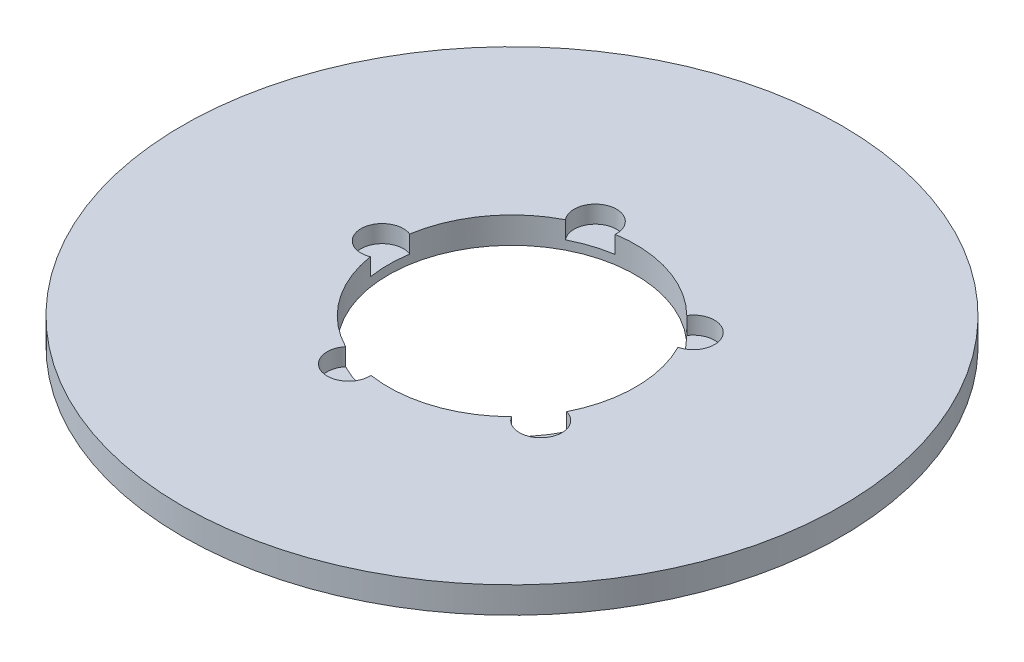
ISO-10303-21;
HEADER;
FILE_DESCRIPTION(('STEP AP214'),'2;1');
FILE_NAME('part.step','',(''),(''),'','','');
FILE_SCHEMA(('AUTOMOTIVE_DESIGN { 1 0 10303 214 1 1 1 1 }'));
ENDSEC;
DATA;
#1=APPLICATION_CONTEXT('core data for automotive mechanical design processes');
#2=APPLICATION_PROTOCOL_DEFINITION('international standard','automotive_design',2000,#1);
#3=PRODUCT_CONTEXT('',#1,'mechanical');
#4=PRODUCT('Part','Part','',(#3));
#5=PRODUCT_RELATED_PRODUCT_CATEGORY('part','',(#4));
#6=PRODUCT_DEFINITION_FORMATION('','',#4);
#7=PRODUCT_DEFINITION_CONTEXT('part definition',#1,'design');
#8=PRODUCT_DEFINITION('design','',#6,#7);
#9=PRODUCT_DEFINITION_SHAPE('','',#8);
#10=(LENGTH_UNIT() NAMED_UNIT(*) SI_UNIT(.MILLI.,.METRE.));
#11=(NAMED_UNIT(*) PLANE_ANGLE_UNIT() SI_UNIT($,.RADIAN.));
#12=(NAMED_UNIT(*) SI_UNIT($,.STERADIAN.) SOLID_ANGLE_UNIT());
#13=UNCERTAINTY_MEASURE_WITH_UNIT(LENGTH_MEASURE(1.E-05),#10,'distance_accuracy_value','');
#14=(GEOMETRIC_REPRESENTATION_CONTEXT(3) GLOBAL_UNCERTAINTY_ASSIGNED_CONTEXT((#13)) GLOBAL_UNIT_ASSIGNED_CONTEXT((#10,
#11,#12)) REPRESENTATION_CONTEXT('',''));
#15=CARTESIAN_POINT('',(0.,0.,0.));
#16=DIRECTION('',(0.,0.,1.));
#17=DIRECTION('',(1.,0.,0.));
#18=AXIS2_PLACEMENT_3D('',#15,#16,#17);
#19=CARTESIAN_POINT('',(0.,8.,0.));
#20=DIRECTION('',(0.,-1.,0.));
#21=DIRECTION('',(0.,0.,-1.));
#22=AXIS2_PLACEMENT_3D('',#19,#20,#21);
#23=CYLINDRICAL_SURFACE('',#22,100.);
#24=CARTESIAN_POINT('',(0.,8.,0.));
#25=DIRECTION('',(0.,1.,0.));
#26=DIRECTION('',(0.,0.,1.));
#27=AXIS2_PLACEMENT_3D('',#24,#25,#26);
#28=CIRCLE('',#27,100.);
#29=CARTESIAN_POINT('',(0.,8.,100.));
#30=VERTEX_POINT('',#29);
#31=EDGE_CURVE('E160',#30,#30,#28,.T.);
#32=ORIENTED_EDGE('',*,*,#31,.F.);
#33=EDGE_LOOP('',(#32));
#34=FACE_BOUND('',#33,.T.);
#35=CARTESIAN_POINT('',(0.,0.,0.));
#36=DIRECTION('',(0.,1.,0.));
#37=DIRECTION('',(0.,0.,1.));
#38=AXIS2_PLACEMENT_3D('',#35,#36,#37);
#39=CIRCLE('',#38,100.);
#40=CARTESIAN_POINT('',(0.,0.,100.));
#41=VERTEX_POINT('',#40);
#42=EDGE_CURVE('E153',#41,#41,#39,.T.);
#43=ORIENTED_EDGE('',*,*,#42,.T.);
#44=EDGE_LOOP('',(#43));
#45=FACE_BOUND('',#44,.T.);
#46=ADVANCED_FACE('F39',(#34,#45),#23,.T.);
#47=CARTESIAN_POINT('',(0.,8.,0.));
#48=DIRECTION('',(0.,1.,0.));
#49=DIRECTION('',(0.,0.,1.));
#50=AXIS2_PLACEMENT_3D('',#47,#48,#49);
#51=PLANE('',#50);
#52=CARTESIAN_POINT('',(-12.1685359282794,8.,37.4509026979913));
#53=DIRECTION('',(0.,1.,0.));
#54=DIRECTION('',(0.951056516295155,0.,0.309016994374945));
#55=AXIS2_PLACEMENT_3D('',#52,#53,#54);
#56=CIRCLE('',#55,6.43902604713494);
#57=CARTESIAN_POINT('',(-17.1370788284352,8.,33.355217421387));
#58=VERTEX_POINT('',#57);
#59=CARTESIAN_POINT('',(-5.74151688115287,8.,37.0578599477012));
#60=VERTEX_POINT('',#59);
#61=EDGE_CURVE('E186',#58,#60,#56,.T.);
#62=ORIENTED_EDGE('',*,*,#61,.F.);
#63=CARTESIAN_POINT('',(0.,8.,0.));
#64=DIRECTION('',(0.,1.,0.));
#65=DIRECTION('',(0.,0.,1.));
#66=AXIS2_PLACEMENT_3D('',#63,#64,#65);
#67=CIRCLE('',#66,37.5);
#68=CARTESIAN_POINT('',(-37.0183454729813,8.,5.9910014557672));
#69=VERTEX_POINT('',#68);
#70=EDGE_CURVE('E148',#69,#58,#67,.T.);
#71=ORIENTED_EDGE('',*,*,#70,.F.);
#72=CARTESIAN_POINT('',(-39.3782094505608,8.,0.));
#73=DIRECTION('',(0.,1.,0.));
#74=DIRECTION('',(0.,0.,1.));
#75=AXIS2_PLACEMENT_3D('',#72,#73,#74);
#76=CIRCLE('',#75,6.43902604713494);
#77=CARTESIAN_POINT('',(-37.0183454729813,8.,-5.9910014557672));
#78=VERTEX_POINT('',#77);
#79=EDGE_CURVE('E142',#78,#69,#76,.T.);
#80=ORIENTED_EDGE('',*,*,#79,.F.);
#81=CARTESIAN_POINT('',(-17.1370788284357,8.,-33.3552174213868));
#82=VERTEX_POINT('',#81);
#83=EDGE_CURVE('E132',#82,#78,#67,.T.);
#84=ORIENTED_EDGE('',*,*,#83,.F.);
#85=CARTESIAN_POINT('',(-12.1685359282799,8.,-37.4509026979911));
#86=DIRECTION('',(0.,1.,0.));
#87=DIRECTION('',(-0.95105651629515,0.,0.309016994374958));
#88=AXIS2_PLACEMENT_3D('',#85,#86,#87);
#89=CIRCLE('',#88,6.43902604713494);
#90=CARTESIAN_POINT('',(-5.7415168811534,8.,-37.0578599477011));
#91=VERTEX_POINT('',#90);
#92=EDGE_CURVE('E111',#91,#82,#89,.T.);
#93=ORIENTED_EDGE('',*,*,#92,.F.);
#94=CARTESIAN_POINT('',(26.4270482891218,8.,-26.6056595243272));
#95=VERTEX_POINT('',#94);
#96=EDGE_CURVE('E141',#95,#91,#67,.T.);
#97=ORIENTED_EDGE('',*,*,#96,.F.);
#98=CARTESIAN_POINT('',(31.8576406535597,8.,-23.145930776724));
#99=DIRECTION('',(0.,1.,0.));
#100=DIRECTION('',(-0.58778525229248,0.,-0.809016994374942));
#101=AXIS2_PLACEMENT_3D('',#98,#99,#100);
#102=CIRCLE('',#101,6.43902604713494);
#103=CARTESIAN_POINT('',(33.4698928934473,8.,-16.9120155422458));
#104=VERTEX_POINT('',#103);
#105=EDGE_CURVE('E173',#104,#95,#102,.T.);
#106=ORIENTED_EDGE('',*,*,#105,.F.);
#107=CARTESIAN_POINT('',(33.4698928934476,8.,16.9120155422453));
#108=VERTEX_POINT('',#107);
#109=EDGE_CURVE('E150',#108,#104,#67,.T.);
#110=ORIENTED_EDGE('',*,*,#109,.F.);
#111=CARTESIAN_POINT('',(31.85764065356,8.,23.1459307767236));
#112=DIRECTION('',(0.,1.,0.));
#113=DIRECTION('',(0.587785252292469,0.,-0.809016994374951));
#114=AXIS2_PLACEMENT_3D('',#111,#112,#113);
#115=CIRCLE('',#114,6.43902604713494);
#116=CARTESIAN_POINT('',(26.4270482891222,8.,26.6056595243268));
#117=VERTEX_POINT('',#116);
#118=EDGE_CURVE('E172',#117,#108,#115,.T.);
#119=ORIENTED_EDGE('',*,*,#118,.F.);
#120=EDGE_CURVE('E152',#60,#117,#67,.T.);
#121=ORIENTED_EDGE('',*,*,#120,.F.);
#122=EDGE_LOOP('',(#62,#71,#80,#84,#93,#97,#106,#110,#119,#121));
#123=FACE_BOUND('',#122,.T.);
#124=ORIENTED_EDGE('',*,*,#31,.T.);
#125=EDGE_LOOP('',(#124));
#126=FACE_BOUND('',#125,.T.);
#127=ADVANCED_FACE('F138',(#123,#126),#51,.T.);
#128=CARTESIAN_POINT('',(0.,0.,0.));
#129=DIRECTION('',(0.,1.,0.));
#130=DIRECTION('',(0.,0.,1.));
#131=AXIS2_PLACEMENT_3D('',#128,#129,#130);
#132=PLANE('',#131);
#133=CARTESIAN_POINT('',(0.,0.,0.));
#134=DIRECTION('',(0.,1.,0.));
#135=DIRECTION('',(0.,0.,1.));
#136=AXIS2_PLACEMENT_3D('',#133,#134,#135);
#137=CIRCLE('',#136,37.5);
#138=CARTESIAN_POINT('',(0.,0.,37.5));
#139=VERTEX_POINT('',#138);
#140=EDGE_CURVE('E145',#139,#139,#137,.T.);
#141=ORIENTED_EDGE('',*,*,#140,.T.);
#142=EDGE_LOOP('',(#141));
#143=FACE_BOUND('',#142,.T.);
#144=ORIENTED_EDGE('',*,*,#42,.F.);
#145=EDGE_LOOP('',(#144));
#146=FACE_BOUND('',#145,.T.);
#147=ADVANCED_FACE('F216',(#143,#146),#132,.F.);
#148=CARTESIAN_POINT('',(0.,8.,0.));
#149=DIRECTION('',(0.,-1.,0.));
#150=DIRECTION('',(0.,0.,-1.));
#151=AXIS2_PLACEMENT_3D('',#148,#149,#150);
#152=CYLINDRICAL_SURFACE('',#151,37.5);
#153=DIRECTION('',(0.,1.,0.));
#154=VECTOR('',#153,1.);
#155=CARTESIAN_POINT('',(-17.1370788284352,5.35642160261757,33.355217421387));
#156=LINE('',#155,#154);
#157=CARTESIAN_POINT('',(-17.1370788284352,2.71284320523514,33.355217421387));
#158=VERTEX_POINT('',#157);
#159=EDGE_CURVE('E11',#158,#58,#156,.T.);
#160=ORIENTED_EDGE('',*,*,#159,.F.);
#161=CARTESIAN_POINT('',(0.,2.71284320523514,0.));
#162=DIRECTION('',(0.,1.,0.));
#163=DIRECTION('',(0.,0.,1.));
#164=AXIS2_PLACEMENT_3D('',#161,#162,#163);
#165=CIRCLE('',#164,37.5);
#166=CARTESIAN_POINT('',(-5.74151688115287,2.71284320523514,37.0578599477012));
#167=VERTEX_POINT('',#166);
#168=EDGE_CURVE('E192',#158,#167,#165,.T.);
#169=ORIENTED_EDGE('',*,*,#168,.T.);
#170=DIRECTION('',(0.,1.,0.));
#171=VECTOR('',#170,1.);
#172=CARTESIAN_POINT('',(-5.74151688115287,5.35642160261757,37.0578599477012));
#173=LINE('',#172,#171);
#174=EDGE_CURVE('E46',#60,#167,#173,.F.);
#175=ORIENTED_EDGE('',*,*,#174,.F.);
#176=ORIENTED_EDGE('',*,*,#120,.T.);
#177=DIRECTION('',(0.,1.,0.));
#178=VECTOR('',#177,1.);
#179=CARTESIAN_POINT('',(26.4270482891222,5.35642160261757,26.6056595243268));
#180=LINE('',#179,#178);
#181=CARTESIAN_POINT('',(26.4270482891222,2.71284320523514,26.6056595243268));
#182=VERTEX_POINT('',#181);
#183=EDGE_CURVE('E195',#182,#117,#180,.T.);
#184=ORIENTED_EDGE('',*,*,#183,.F.);
#185=CARTESIAN_POINT('',(0.,2.71284320523514,0.));
#186=DIRECTION('',(0.,1.,0.));
#187=DIRECTION('',(0.,0.,1.));
#188=AXIS2_PLACEMENT_3D('',#185,#186,#187);
#189=CIRCLE('',#188,37.5);
#190=CARTESIAN_POINT('',(33.4698928934476,2.71284320523514,16.9120155422453));
#191=VERTEX_POINT('',#190);
#192=EDGE_CURVE('E197',#182,#191,#189,.T.);
#193=ORIENTED_EDGE('',*,*,#192,.T.);
#194=DIRECTION('',(0.,1.,0.));
#195=VECTOR('',#194,1.);
#196=CARTESIAN_POINT('',(33.4698928934476,5.35642160261757,16.9120155422453));
#197=LINE('',#196,#195);
#198=EDGE_CURVE('E168',#108,#191,#197,.F.);
#199=ORIENTED_EDGE('',*,*,#198,.F.);
#200=ORIENTED_EDGE('',*,*,#109,.T.);
#201=DIRECTION('',(0.,1.,0.));
#202=VECTOR('',#201,1.);
#203=CARTESIAN_POINT('',(33.4698928934473,5.35642160261757,-16.9120155422458));
#204=LINE('',#203,#202);
#205=CARTESIAN_POINT('',(33.4698928934473,2.71284320523514,-16.9120155422458));
#206=VERTEX_POINT('',#205);
#207=EDGE_CURVE('E169',#206,#104,#204,.T.);
#208=ORIENTED_EDGE('',*,*,#207,.F.);
#209=CARTESIAN_POINT('',(0.,2.71284320523514,0.));
#210=DIRECTION('',(0.,1.,0.));
#211=DIRECTION('',(0.,0.,1.));
#212=AXIS2_PLACEMENT_3D('',#209,#210,#211);
#213=CIRCLE('',#212,37.5);
#214=CARTESIAN_POINT('',(26.4270482891218,2.71284320523514,-26.6056595243272));
#215=VERTEX_POINT('',#214);
#216=EDGE_CURVE('E332',#206,#215,#213,.T.);
#217=ORIENTED_EDGE('',*,*,#216,.T.);
#218=DIRECTION('',(0.,1.,0.));
#219=VECTOR('',#218,1.);
#220=CARTESIAN_POINT('',(26.4270482891218,5.35642160261757,-26.6056595243272));
#221=LINE('',#220,#219);
#222=EDGE_CURVE('E335',#95,#215,#221,.F.);
#223=ORIENTED_EDGE('',*,*,#222,.F.);
#224=ORIENTED_EDGE('',*,*,#96,.T.);
#225=DIRECTION('',(0.,1.,0.));
#226=VECTOR('',#225,1.);
#227=CARTESIAN_POINT('',(-5.7415168811534,5.35642160261757,-37.0578599477011));
#228=LINE('',#227,#226);
#229=CARTESIAN_POINT('',(-5.7415168811534,2.71284320523514,-37.0578599477011));
#230=VERTEX_POINT('',#229);
#231=EDGE_CURVE('E121',#230,#91,#228,.T.);
#232=ORIENTED_EDGE('',*,*,#231,.F.);
#233=CARTESIAN_POINT('',(0.,2.71284320523514,0.));
#234=DIRECTION('',(0.,1.,0.));
#235=DIRECTION('',(0.,0.,1.));
#236=AXIS2_PLACEMENT_3D('',#233,#234,#235);
#237=CIRCLE('',#236,37.5);
#238=CARTESIAN_POINT('',(-17.1370788284357,2.71284320523514,-33.3552174213868));
#239=VERTEX_POINT('',#238);
#240=EDGE_CURVE('E134',#230,#239,#237,.T.);
#241=ORIENTED_EDGE('',*,*,#240,.T.);
#242=DIRECTION('',(0.,1.,0.));
#243=VECTOR('',#242,1.);
#244=CARTESIAN_POINT('',(-17.1370788284357,5.35642160261757,-33.3552174213868));
#245=LINE('',#244,#243);
#246=EDGE_CURVE('E117',#82,#239,#245,.F.);
#247=ORIENTED_EDGE('',*,*,#246,.F.);
#248=ORIENTED_EDGE('',*,*,#83,.T.);
#249=DIRECTION('',(0.,1.,0.));
#250=VECTOR('',#249,1.);
#251=CARTESIAN_POINT('',(-37.0183454729813,5.35642160261757,-5.9910014557672));
#252=LINE('',#251,#250);
#253=CARTESIAN_POINT('',(-37.0183454729813,2.71284320523514,-5.9910014557672));
#254=VERTEX_POINT('',#253);
#255=EDGE_CURVE('E338',#254,#78,#252,.T.);
#256=ORIENTED_EDGE('',*,*,#255,.F.);
#257=CARTESIAN_POINT('',(0.,2.71284320523514,0.));
#258=DIRECTION('',(0.,1.,0.));
#259=DIRECTION('',(0.,0.,1.));
#260=AXIS2_PLACEMENT_3D('',#257,#258,#259);
#261=CIRCLE('',#260,37.5);
#262=CARTESIAN_POINT('',(-37.0183454729813,2.71284320523514,5.9910014557672));
#263=VERTEX_POINT('',#262);
#264=EDGE_CURVE('E342',#254,#263,#261,.T.);
#265=ORIENTED_EDGE('',*,*,#264,.T.);
#266=DIRECTION('',(0.,1.,0.));
#267=VECTOR('',#266,1.);
#268=CARTESIAN_POINT('',(-37.0183454729813,5.35642160261757,5.9910014557672));
#269=LINE('',#268,#267);
#270=EDGE_CURVE('E341',#69,#263,#269,.F.);
#271=ORIENTED_EDGE('',*,*,#270,.F.);
#272=ORIENTED_EDGE('',*,*,#70,.T.);
#273=EDGE_LOOP('',(#160,#169,#175,#176,#184,#193,#199,#200,#208,#217,#223,#224,#232,#241,#247,
#248,#256,#265,#271,#272));
#274=FACE_BOUND('',#273,.T.);
#275=ORIENTED_EDGE('',*,*,#140,.F.);
#276=EDGE_LOOP('',(#275));
#277=FACE_BOUND('',#276,.T.);
#278=ADVANCED_FACE('F128',(#274,#277),#152,.F.);
#279=CARTESIAN_POINT('',(-39.3782094505608,2.71284320523514,0.));
#280=DIRECTION('',(0.,1.,0.));
#281=DIRECTION('',(0.,0.,1.));
#282=AXIS2_PLACEMENT_3D('',#279,#280,#281);
#283=CYLINDRICAL_SURFACE('',#282,6.43902604713494);
#284=ORIENTED_EDGE('',*,*,#255,.T.);
#285=ORIENTED_EDGE('',*,*,#79,.T.);
#286=ORIENTED_EDGE('',*,*,#270,.T.);
#287=CARTESIAN_POINT('',(-39.3782094505608,2.71284320523514,0.));
#288=DIRECTION('',(0.,1.,0.));
#289=DIRECTION('',(0.,0.,1.));
#290=AXIS2_PLACEMENT_3D('',#287,#288,#289);
#291=CIRCLE('',#290,6.43902604713494);
#292=EDGE_CURVE('E149',#254,#263,#291,.T.);
#293=ORIENTED_EDGE('',*,*,#292,.F.);
#294=EDGE_LOOP('',(#284,#285,#286,#293));
#295=FACE_BOUND('',#294,.T.);
#296=ADVANCED_FACE('F227',(#295),#283,.F.);
#297=CARTESIAN_POINT('',(-39.3782094505608,2.71284320523514,0.));
#298=DIRECTION('',(0.,1.,0.));
#299=DIRECTION('',(0.,0.,1.));
#300=AXIS2_PLACEMENT_3D('',#297,#298,#299);
#301=PLANE('',#300);
#302=ORIENTED_EDGE('',*,*,#292,.T.);
#303=ORIENTED_EDGE('',*,*,#264,.F.);
#304=EDGE_LOOP('',(#302,#303));
#305=FACE_BOUND('',#304,.T.);
#306=ADVANCED_FACE('F235',(#305),#301,.T.);
#307=CARTESIAN_POINT('',(-12.1685359282799,2.71284320523514,-37.4509026979911));
#308=DIRECTION('',(0.,1.,0.));
#309=DIRECTION('',(0.,0.,1.));
#310=AXIS2_PLACEMENT_3D('',#307,#308,#309);
#311=CYLINDRICAL_SURFACE('',#310,6.43902604713494);
#312=ORIENTED_EDGE('',*,*,#231,.T.);
#313=ORIENTED_EDGE('',*,*,#92,.T.);
#314=ORIENTED_EDGE('',*,*,#246,.T.);
#315=CARTESIAN_POINT('',(-12.1685359282799,2.71284320523514,-37.4509026979911));
#316=DIRECTION('',(0.,1.,0.));
#317=DIRECTION('',(-0.95105651629515,0.,0.309016994374958));
#318=AXIS2_PLACEMENT_3D('',#315,#316,#317);
#319=CIRCLE('',#318,6.43902604713494);
#320=EDGE_CURVE('E127',#230,#239,#319,.T.);
#321=ORIENTED_EDGE('',*,*,#320,.F.);
#322=EDGE_LOOP('',(#312,#313,#314,#321));
#323=FACE_BOUND('',#322,.T.);
#324=ADVANCED_FACE('F116',(#323),#311,.F.);
#325=CARTESIAN_POINT('',(-12.1685359282799,2.71284320523514,-37.4509026979911));
#326=DIRECTION('',(0.,1.,0.));
#327=DIRECTION('',(-0.95105651629515,0.,0.309016994374958));
#328=AXIS2_PLACEMENT_3D('',#325,#326,#327);
#329=PLANE('',#328);
#330=ORIENTED_EDGE('',*,*,#320,.T.);
#331=ORIENTED_EDGE('',*,*,#240,.F.);
#332=EDGE_LOOP('',(#330,#331));
#333=FACE_BOUND('',#332,.T.);
#334=ADVANCED_FACE('F236',(#333),#329,.T.);
#335=CARTESIAN_POINT('',(31.8576406535597,2.71284320523514,-23.145930776724));
#336=DIRECTION('',(0.,1.,0.));
#337=DIRECTION('',(0.,0.,1.));
#338=AXIS2_PLACEMENT_3D('',#335,#336,#337);
#339=CYLINDRICAL_SURFACE('',#338,6.43902604713494);
#340=ORIENTED_EDGE('',*,*,#207,.T.);
#341=ORIENTED_EDGE('',*,*,#105,.T.);
#342=ORIENTED_EDGE('',*,*,#222,.T.);
#343=CARTESIAN_POINT('',(31.8576406535597,2.71284320523514,-23.145930776724));
#344=DIRECTION('',(0.,1.,0.));
#345=DIRECTION('',(-0.58778525229248,0.,-0.809016994374942));
#346=AXIS2_PLACEMENT_3D('',#343,#344,#345);
#347=CIRCLE('',#346,6.43902604713494);
#348=EDGE_CURVE('E177',#206,#215,#347,.T.);
#349=ORIENTED_EDGE('',*,*,#348,.F.);
#350=EDGE_LOOP('',(#340,#341,#342,#349));
#351=FACE_BOUND('',#350,.T.);
#352=ADVANCED_FACE('F241',(#351),#339,.F.);
#353=CARTESIAN_POINT('',(31.8576406535597,2.71284320523514,-23.145930776724));
#354=DIRECTION('',(0.,1.,0.));
#355=DIRECTION('',(-0.58778525229248,0.,-0.809016994374942));
#356=AXIS2_PLACEMENT_3D('',#353,#354,#355);
#357=PLANE('',#356);
#358=ORIENTED_EDGE('',*,*,#348,.T.);
#359=ORIENTED_EDGE('',*,*,#216,.F.);
#360=EDGE_LOOP('',(#358,#359));
#361=FACE_BOUND('',#360,.T.);
#362=ADVANCED_FACE('F244',(#361),#357,.T.);
#363=CARTESIAN_POINT('',(31.85764065356,2.71284320523514,23.1459307767236));
#364=DIRECTION('',(0.,1.,0.));
#365=DIRECTION('',(0.,0.,1.));
#366=AXIS2_PLACEMENT_3D('',#363,#364,#365);
#367=CYLINDRICAL_SURFACE('',#366,6.43902604713494);
#368=ORIENTED_EDGE('',*,*,#183,.T.);
#369=ORIENTED_EDGE('',*,*,#118,.T.);
#370=ORIENTED_EDGE('',*,*,#198,.T.);
#371=CARTESIAN_POINT('',(31.85764065356,2.71284320523514,23.1459307767236));
#372=DIRECTION('',(0.,1.,0.));
#373=DIRECTION('',(0.587785252292469,0.,-0.809016994374951));
#374=AXIS2_PLACEMENT_3D('',#371,#372,#373);
#375=CIRCLE('',#374,6.43902604713494);
#376=EDGE_CURVE('E56',#182,#191,#375,.T.);
#377=ORIENTED_EDGE('',*,*,#376,.F.);
#378=EDGE_LOOP('',(#368,#369,#370,#377));
#379=FACE_BOUND('',#378,.T.);
#380=ADVANCED_FACE('F191',(#379),#367,.F.);
#381=CARTESIAN_POINT('',(31.85764065356,2.71284320523514,23.1459307767236));
#382=DIRECTION('',(0.,1.,0.));
#383=DIRECTION('',(0.587785252292469,0.,-0.809016994374951));
#384=AXIS2_PLACEMENT_3D('',#381,#382,#383);
#385=PLANE('',#384);
#386=ORIENTED_EDGE('',*,*,#376,.T.);
#387=ORIENTED_EDGE('',*,*,#192,.F.);
#388=EDGE_LOOP('',(#386,#387));
#389=FACE_BOUND('',#388,.T.);
#390=ADVANCED_FACE('F208',(#389),#385,.T.);
#391=CARTESIAN_POINT('',(-12.1685359282794,2.71284320523514,37.4509026979913));
#392=DIRECTION('',(0.,1.,0.));
#393=DIRECTION('',(0.,0.,1.));
#394=AXIS2_PLACEMENT_3D('',#391,#392,#393);
#395=CYLINDRICAL_SURFACE('',#394,6.43902604713494);
#396=ORIENTED_EDGE('',*,*,#159,.T.);
#397=ORIENTED_EDGE('',*,*,#61,.T.);
#398=ORIENTED_EDGE('',*,*,#174,.T.);
#399=CARTESIAN_POINT('',(-12.1685359282794,2.71284320523514,37.4509026979913));
#400=DIRECTION('',(0.,1.,0.));
#401=DIRECTION('',(0.951056516295155,0.,0.309016994374945));
#402=AXIS2_PLACEMENT_3D('',#399,#400,#401);
#403=CIRCLE('',#402,6.43902604713494);
#404=EDGE_CURVE('E55',#158,#167,#403,.T.);
#405=ORIENTED_EDGE('',*,*,#404,.F.);
#406=EDGE_LOOP('',(#396,#397,#398,#405));
#407=FACE_BOUND('',#406,.T.);
#408=ADVANCED_FACE('F203',(#407),#395,.F.);
#409=CARTESIAN_POINT('',(-12.1685359282794,2.71284320523514,37.4509026979913));
#410=DIRECTION('',(0.,1.,0.));
#411=DIRECTION('',(0.951056516295155,0.,0.309016994374945));
#412=AXIS2_PLACEMENT_3D('',#409,#410,#411);
#413=PLANE('',#412);
#414=ORIENTED_EDGE('',*,*,#404,.T.);
#415=ORIENTED_EDGE('',*,*,#168,.F.);
#416=EDGE_LOOP('',(#414,#415));
#417=FACE_BOUND('',#416,.T.);
#418=ADVANCED_FACE('F205',(#417),#413,.T.);
#419=CLOSED_SHELL('',(#46,#127,#147,#278,#296,#306,#324,#334,#352,#362,#380,#390,#408,#418));
#420=MANIFOLD_SOLID_BREP('B2',#419);
#421=ADVANCED_BREP_SHAPE_REPRESENTATION('',(#18,#420),#14);
#422=SHAPE_DEFINITION_REPRESENTATION(#9,#421);
ENDSEC;
END-ISO-10303-21;
